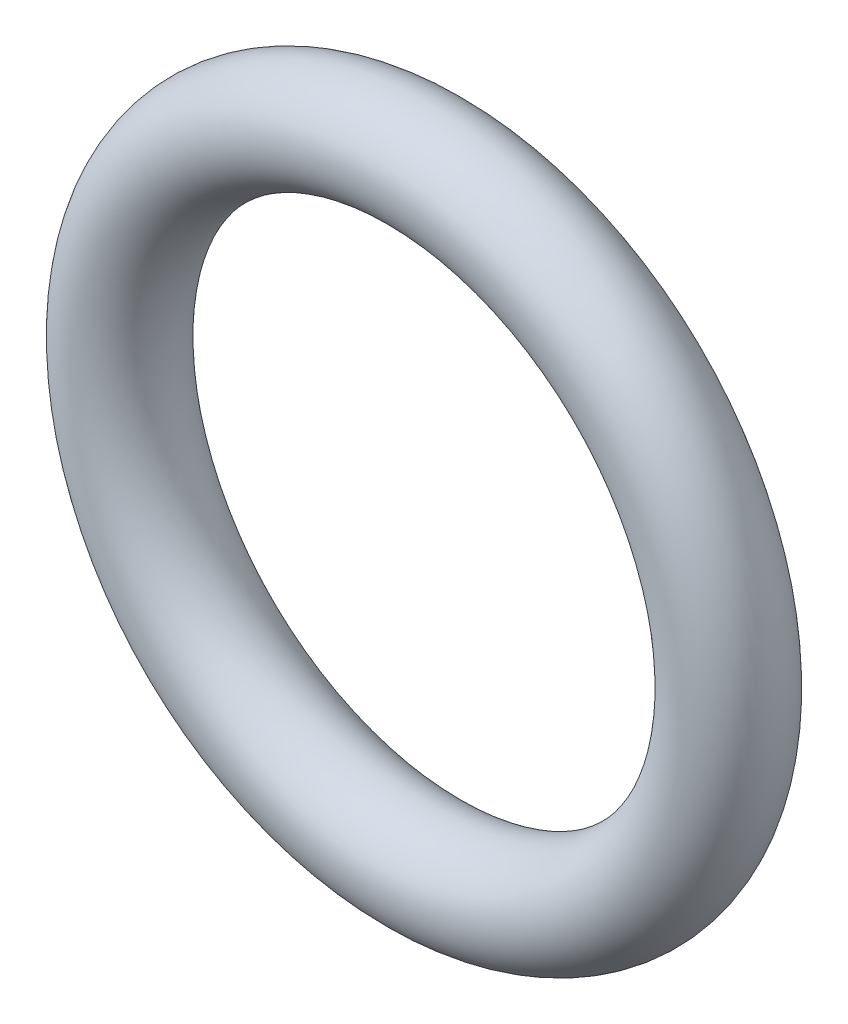
ISO-10303-21;
HEADER;
FILE_DESCRIPTION(('STEP AP214'),'2;1');
FILE_NAME('part.step','',(''),(''),'','','');
FILE_SCHEMA(('AUTOMOTIVE_DESIGN { 1 0 10303 214 1 1 1 1 }'));
ENDSEC;
DATA;
#1=APPLICATION_CONTEXT('core data for automotive mechanical design processes');
#2=APPLICATION_PROTOCOL_DEFINITION('international standard','automotive_design',2000,#1);
#3=PRODUCT_CONTEXT('',#1,'mechanical');
#4=PRODUCT('Part','Part','',(#3));
#5=PRODUCT_RELATED_PRODUCT_CATEGORY('part','',(#4));
#6=PRODUCT_DEFINITION_FORMATION('','',#4);
#7=PRODUCT_DEFINITION_CONTEXT('part definition',#1,'design');
#8=PRODUCT_DEFINITION('design','',#6,#7);
#9=PRODUCT_DEFINITION_SHAPE('','',#8);
#10=(LENGTH_UNIT() NAMED_UNIT(*) SI_UNIT(.MILLI.,.METRE.));
#11=(NAMED_UNIT(*) PLANE_ANGLE_UNIT() SI_UNIT($,.RADIAN.));
#12=(NAMED_UNIT(*) SI_UNIT($,.STERADIAN.) SOLID_ANGLE_UNIT());
#13=UNCERTAINTY_MEASURE_WITH_UNIT(LENGTH_MEASURE(1.E-05),#10,'distance_accuracy_value','');
#14=(GEOMETRIC_REPRESENTATION_CONTEXT(3) GLOBAL_UNCERTAINTY_ASSIGNED_CONTEXT((#13)) GLOBAL_UNIT_ASSIGNED_CONTEXT((#10,
#11,#12)) REPRESENTATION_CONTEXT('',''));
#15=CARTESIAN_POINT('',(0.,0.,0.));
#16=DIRECTION('',(0.,0.,1.));
#17=DIRECTION('',(1.,0.,0.));
#18=AXIS2_PLACEMENT_3D('',#15,#16,#17);
#19=CARTESIAN_POINT('',(0.,-13.39453125,0.));
#20=DIRECTION('',(0.,0.,1.));
#21=DIRECTION('',(1.,0.,0.));
#22=AXIS2_PLACEMENT_3D('',#19,#20,#21);
#23=TOROIDAL_SURFACE('',#22,13.39453125,2.28203125);
#24=CARTESIAN_POINT('',(0.,0.,0.));
#25=DIRECTION('',(1.,0.,0.));
#26=DIRECTION('',(0.,0.,-1.));
#27=AXIS2_PLACEMENT_3D('',#24,#25,#26);
#28=CIRCLE('',#27,2.28203125);
#29=CARTESIAN_POINT('',(0.,2.28203124999999,0.));
#30=VERTEX_POINT('',#29);
#31=EDGE_CURVE('E12',#30,#30,#28,.T.);
#32=CARTESIAN_POINT('',(0.,-13.39453125,0.));
#33=DIRECTION('',(0.,0.,1.));
#34=DIRECTION('',(1.,0.,0.));
#35=AXIS2_PLACEMENT_3D('',#32,#33,#34);
#36=CIRCLE('',#35,15.6765625);
#37=EDGE_CURVE('',#30,#30,#36,.T.);
#38=ORIENTED_EDGE('',*,*,#31,.F.);
#39=ORIENTED_EDGE('',*,*,#31,.T.);
#40=ORIENTED_EDGE('',*,*,#37,.T.);
#41=ORIENTED_EDGE('',*,*,#37,.F.);
#42=EDGE_LOOP('',(#38,#40,#39,#41));
#43=FACE_BOUND('',#42,.T.);
#44=ADVANCED_FACE('F46',(#43),#23,.T.);
#45=CLOSED_SHELL('',(#44));
#46=MANIFOLD_SOLID_BREP('B2',#45);
#47=ADVANCED_BREP_SHAPE_REPRESENTATION('',(#18,#46),#14);
#48=SHAPE_DEFINITION_REPRESENTATION(#9,#47);
ENDSEC;
END-ISO-10303-21;
